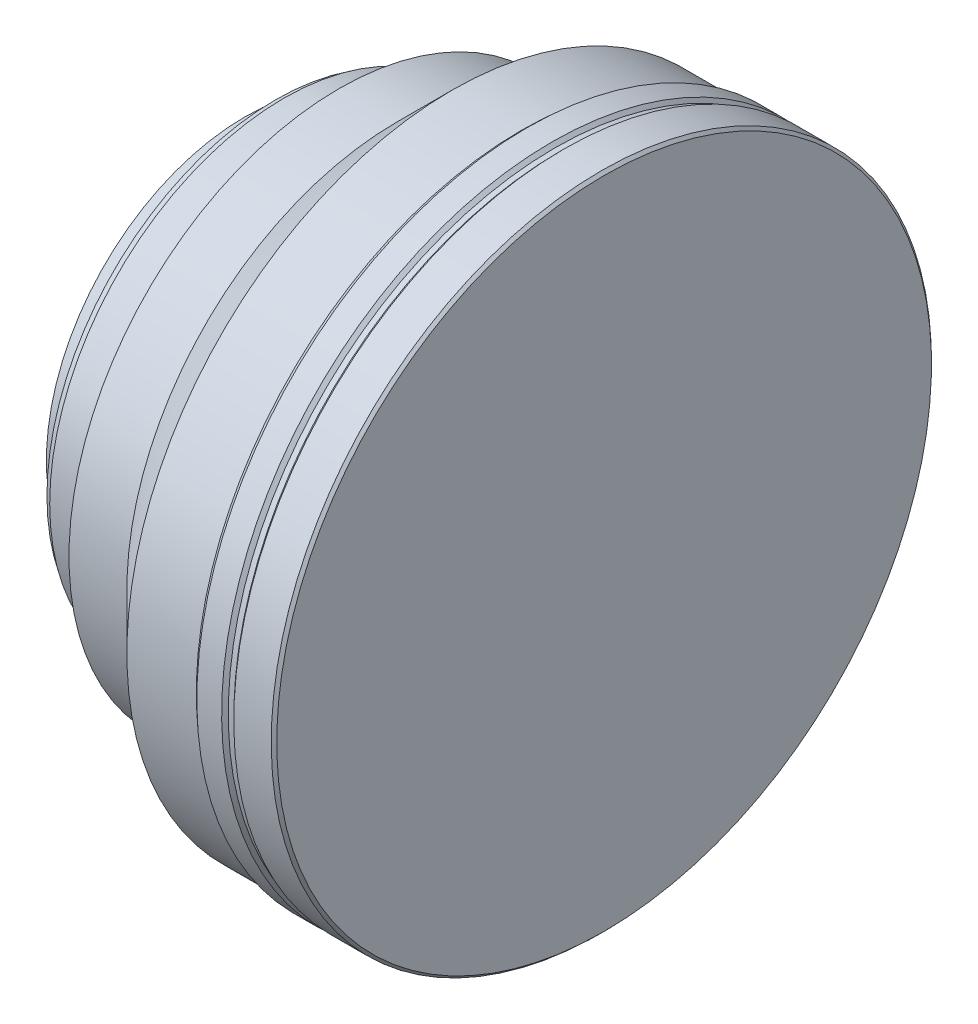
ISO-10303-21;
HEADER;
FILE_DESCRIPTION(('STEP AP214'),'2;1');
FILE_NAME('part.step','',(''),(''),'','','');
FILE_SCHEMA(('AUTOMOTIVE_DESIGN { 1 0 10303 214 1 1 1 1 }'));
ENDSEC;
DATA;
#1=APPLICATION_CONTEXT('core data for automotive mechanical design processes');
#2=APPLICATION_PROTOCOL_DEFINITION('international standard','automotive_design',2000,#1);
#3=PRODUCT_CONTEXT('',#1,'mechanical');
#4=PRODUCT('Part','Part','',(#3));
#5=PRODUCT_RELATED_PRODUCT_CATEGORY('part','',(#4));
#6=PRODUCT_DEFINITION_FORMATION('','',#4);
#7=PRODUCT_DEFINITION_CONTEXT('part definition',#1,'design');
#8=PRODUCT_DEFINITION('design','',#6,#7);
#9=PRODUCT_DEFINITION_SHAPE('','',#8);
#10=(LENGTH_UNIT() NAMED_UNIT(*) SI_UNIT(.MILLI.,.METRE.));
#11=(NAMED_UNIT(*) PLANE_ANGLE_UNIT() SI_UNIT($,.RADIAN.));
#12=(NAMED_UNIT(*) SI_UNIT($,.STERADIAN.) SOLID_ANGLE_UNIT());
#13=UNCERTAINTY_MEASURE_WITH_UNIT(LENGTH_MEASURE(1.E-05),#10,'distance_accuracy_value','');
#14=(GEOMETRIC_REPRESENTATION_CONTEXT(3) GLOBAL_UNCERTAINTY_ASSIGNED_CONTEXT((#13)) GLOBAL_UNIT_ASSIGNED_CONTEXT((#10,
#11,#12)) REPRESENTATION_CONTEXT('',''));
#15=CARTESIAN_POINT('',(0.,0.,0.));
#16=DIRECTION('',(0.,0.,1.));
#17=DIRECTION('',(1.,0.,0.));
#18=AXIS2_PLACEMENT_3D('',#15,#16,#17);
#19=CARTESIAN_POINT('',(0.,0.,0.));
#20=DIRECTION('',(1.,0.,0.));
#21=DIRECTION('',(0.,1.,0.));
#22=AXIS2_PLACEMENT_3D('',#19,#20,#21);
#23=PLANE('',#22);
#24=CARTESIAN_POINT('',(0.,0.,0.));
#25=DIRECTION('',(1.,0.,0.));
#26=DIRECTION('',(0.,1.,0.));
#27=AXIS2_PLACEMENT_3D('',#24,#25,#26);
#28=CIRCLE('',#27,59.4);
#29=CARTESIAN_POINT('',(0.,59.4,0.));
#30=VERTEX_POINT('',#29);
#31=EDGE_CURVE('E42',#30,#30,#28,.T.);
#32=ORIENTED_EDGE('',*,*,#31,.T.);
#33=EDGE_LOOP('',(#32));
#34=FACE_BOUND('',#33,.T.);
#35=ADVANCED_FACE('F34',(#34),#23,.T.);
#36=CARTESIAN_POINT('',(0.,0.,0.));
#37=DIRECTION('',(1.,0.,0.));
#38=DIRECTION('',(0.,1.,0.));
#39=AXIS2_PLACEMENT_3D('',#36,#37,#38);
#40=CYLINDRICAL_SURFACE('',#39,59.9);
#41=CARTESIAN_POINT('',(-0.49999999999999,0.,0.));
#42=DIRECTION('',(1.,0.,0.));
#43=DIRECTION('',(0.,1.,0.));
#44=AXIS2_PLACEMENT_3D('',#41,#42,#43);
#45=CIRCLE('',#44,59.9);
#46=CARTESIAN_POINT('',(-0.499999999999997,59.9,0.));
#47=VERTEX_POINT('',#46);
#48=EDGE_CURVE('E10',#47,#47,#45,.F.);
#49=ORIENTED_EDGE('',*,*,#48,.T.);
#50=EDGE_LOOP('',(#49));
#51=FACE_BOUND('',#50,.T.);
#52=CARTESIAN_POINT('',(-7.29999999999998,0.,0.));
#53=DIRECTION('',(1.,0.,0.));
#54=DIRECTION('',(0.,1.,0.));
#55=AXIS2_PLACEMENT_3D('',#52,#53,#54);
#56=CIRCLE('',#55,59.9);
#57=CARTESIAN_POINT('',(-7.29999999999998,59.9,0.));
#58=VERTEX_POINT('',#57);
#59=EDGE_CURVE('E46',#58,#58,#56,.T.);
#60=ORIENTED_EDGE('',*,*,#59,.T.);
#61=EDGE_LOOP('',(#60));
#62=FACE_BOUND('',#61,.T.);
#63=ADVANCED_FACE('F127',(#51,#62),#40,.T.);
#64=CARTESIAN_POINT('',(-7.29999999999998,0.,0.));
#65=DIRECTION('',(1.,0.,0.));
#66=DIRECTION('',(0.,1.,0.));
#67=AXIS2_PLACEMENT_3D('',#64,#65,#66);
#68=CONICAL_SURFACE('',#67,59.9,0.78539816339744);
#69=CARTESIAN_POINT('',(-7.89999999999999,0.,0.));
#70=DIRECTION('',(1.,0.,0.));
#71=DIRECTION('',(0.,1.,0.));
#72=AXIS2_PLACEMENT_3D('',#69,#70,#71);
#73=CIRCLE('',#72,59.3);
#74=CARTESIAN_POINT('',(-7.9,59.3,0.));
#75=VERTEX_POINT('',#74);
#76=EDGE_CURVE('E50',#75,#75,#73,.T.);
#77=ORIENTED_EDGE('',*,*,#76,.T.);
#78=EDGE_LOOP('',(#77));
#79=FACE_BOUND('',#78,.T.);
#80=ORIENTED_EDGE('',*,*,#59,.F.);
#81=EDGE_LOOP('',(#80));
#82=FACE_BOUND('',#81,.T.);
#83=ADVANCED_FACE('F131',(#79,#82),#68,.T.);
#84=CARTESIAN_POINT('',(0.,0.,0.));
#85=DIRECTION('',(1.,0.,0.));
#86=DIRECTION('',(0.,1.,0.));
#87=AXIS2_PLACEMENT_3D('',#84,#85,#86);
#88=CYLINDRICAL_SURFACE('',#87,59.3);
#89=CARTESIAN_POINT('',(-8.89999999999999,0.,0.));
#90=DIRECTION('',(1.,0.,0.));
#91=DIRECTION('',(0.,1.,0.));
#92=AXIS2_PLACEMENT_3D('',#89,#90,#91);
#93=CIRCLE('',#92,59.3);
#94=CARTESIAN_POINT('',(-8.9,59.3,0.));
#95=VERTEX_POINT('',#94);
#96=EDGE_CURVE('E55',#95,#95,#93,.T.);
#97=ORIENTED_EDGE('',*,*,#96,.T.);
#98=EDGE_LOOP('',(#97));
#99=FACE_BOUND('',#98,.T.);
#100=ORIENTED_EDGE('',*,*,#76,.F.);
#101=EDGE_LOOP('',(#100));
#102=FACE_BOUND('',#101,.T.);
#103=ADVANCED_FACE('F136',(#99,#102),#88,.T.);
#104=CARTESIAN_POINT('',(-8.89999999999999,0.,0.));
#105=DIRECTION('',(-1.,0.,0.));
#106=DIRECTION('',(0.,-1.,0.));
#107=AXIS2_PLACEMENT_3D('',#104,#105,#106);
#108=CONICAL_SURFACE('',#107,59.3,0.785398163397443);
#109=CARTESIAN_POINT('',(-9.5,0.,0.));
#110=DIRECTION('',(1.,0.,0.));
#111=DIRECTION('',(0.,1.,0.));
#112=AXIS2_PLACEMENT_3D('',#109,#110,#111);
#113=CIRCLE('',#112,59.9);
#114=CARTESIAN_POINT('',(-9.50000000000001,59.9,0.));
#115=VERTEX_POINT('',#114);
#116=EDGE_CURVE('E58',#115,#115,#113,.T.);
#117=ORIENTED_EDGE('',*,*,#116,.T.);
#118=EDGE_LOOP('',(#117));
#119=FACE_BOUND('',#118,.T.);
#120=ORIENTED_EDGE('',*,*,#96,.F.);
#121=EDGE_LOOP('',(#120));
#122=FACE_BOUND('',#121,.T.);
#123=ADVANCED_FACE('F140',(#119,#122),#108,.T.);
#124=CARTESIAN_POINT('',(0.,0.,0.));
#125=DIRECTION('',(1.,0.,0.));
#126=DIRECTION('',(0.,1.,0.));
#127=AXIS2_PLACEMENT_3D('',#124,#125,#126);
#128=CYLINDRICAL_SURFACE('',#127,59.9);
#129=CARTESIAN_POINT('',(-14.,0.,0.));
#130=DIRECTION('',(1.,0.,0.));
#131=DIRECTION('',(0.,1.,0.));
#132=AXIS2_PLACEMENT_3D('',#129,#130,#131);
#133=CIRCLE('',#132,59.9);
#134=CARTESIAN_POINT('',(-14.,59.9,0.));
#135=VERTEX_POINT('',#134);
#136=EDGE_CURVE('E61',#135,#135,#133,.T.);
#137=ORIENTED_EDGE('',*,*,#136,.T.);
#138=EDGE_LOOP('',(#137));
#139=FACE_BOUND('',#138,.T.);
#140=ORIENTED_EDGE('',*,*,#116,.F.);
#141=EDGE_LOOP('',(#140));
#142=FACE_BOUND('',#141,.T.);
#143=ADVANCED_FACE('F144',(#139,#142),#128,.T.);
#144=CARTESIAN_POINT('',(-14.,0.,0.));
#145=DIRECTION('',(1.,0.,0.));
#146=DIRECTION('',(0.,1.,0.));
#147=AXIS2_PLACEMENT_3D('',#144,#145,#146);
#148=CONICAL_SURFACE('',#147,59.9,0.73281510178651);
#149=CARTESIAN_POINT('',(-15.,0.,0.));
#150=DIRECTION('',(1.,0.,0.));
#151=DIRECTION('',(0.,1.,0.));
#152=AXIS2_PLACEMENT_3D('',#149,#150,#151);
#153=CIRCLE('',#152,59.);
#154=CARTESIAN_POINT('',(-15.,59.,0.));
#155=VERTEX_POINT('',#154);
#156=EDGE_CURVE('E64',#155,#155,#153,.T.);
#157=ORIENTED_EDGE('',*,*,#156,.T.);
#158=EDGE_LOOP('',(#157));
#159=FACE_BOUND('',#158,.T.);
#160=ORIENTED_EDGE('',*,*,#136,.F.);
#161=EDGE_LOOP('',(#160));
#162=FACE_BOUND('',#161,.T.);
#163=ADVANCED_FACE('F148',(#159,#162),#148,.T.);
#164=CARTESIAN_POINT('',(0.,0.,0.));
#165=DIRECTION('',(1.,0.,0.));
#166=DIRECTION('',(0.,1.,0.));
#167=AXIS2_PLACEMENT_3D('',#164,#165,#166);
#168=CYLINDRICAL_SURFACE('',#167,59.);
#169=CARTESIAN_POINT('',(-27.6,0.,0.));
#170=DIRECTION('',(1.,0.,0.));
#171=DIRECTION('',(0.,1.,0.));
#172=AXIS2_PLACEMENT_3D('',#169,#170,#171);
#173=CIRCLE('',#172,59.);
#174=CARTESIAN_POINT('',(-27.6,59.,0.));
#175=VERTEX_POINT('',#174);
#176=EDGE_CURVE('E67',#175,#175,#173,.T.);
#177=ORIENTED_EDGE('',*,*,#176,.T.);
#178=EDGE_LOOP('',(#177));
#179=FACE_BOUND('',#178,.T.);
#180=ORIENTED_EDGE('',*,*,#156,.F.);
#181=EDGE_LOOP('',(#180));
#182=FACE_BOUND('',#181,.T.);
#183=ADVANCED_FACE('F152',(#179,#182),#168,.T.);
#184=CARTESIAN_POINT('',(-27.6,0.,0.));
#185=DIRECTION('',(1.,0.,0.));
#186=DIRECTION('',(0.,1.,0.));
#187=AXIS2_PLACEMENT_3D('',#184,#185,#186);
#188=CONICAL_SURFACE('',#187,59.,0.78539816339745);
#189=CARTESIAN_POINT('',(-37.6,0.,0.));
#190=DIRECTION('',(1.,0.,0.));
#191=DIRECTION('',(0.,1.,0.));
#192=AXIS2_PLACEMENT_3D('',#189,#190,#191);
#193=CIRCLE('',#192,49.);
#194=CARTESIAN_POINT('',(-37.6,49.,0.));
#195=VERTEX_POINT('',#194);
#196=EDGE_CURVE('E70',#195,#195,#193,.T.);
#197=ORIENTED_EDGE('',*,*,#196,.T.);
#198=EDGE_LOOP('',(#197));
#199=FACE_BOUND('',#198,.T.);
#200=ORIENTED_EDGE('',*,*,#176,.F.);
#201=EDGE_LOOP('',(#200));
#202=FACE_BOUND('',#201,.T.);
#203=ADVANCED_FACE('F156',(#199,#202),#188,.T.);
#204=CARTESIAN_POINT('',(0.,0.,0.));
#205=DIRECTION('',(1.,0.,0.));
#206=DIRECTION('',(0.,1.,0.));
#207=AXIS2_PLACEMENT_3D('',#204,#205,#206);
#208=CYLINDRICAL_SURFACE('',#207,49.);
#209=CARTESIAN_POINT('',(-48.1,0.,0.));
#210=DIRECTION('',(1.,0.,0.));
#211=DIRECTION('',(0.,1.,0.));
#212=AXIS2_PLACEMENT_3D('',#209,#210,#211);
#213=CIRCLE('',#212,49.);
#214=CARTESIAN_POINT('',(-48.1,49.,0.));
#215=VERTEX_POINT('',#214);
#216=EDGE_CURVE('E73',#215,#215,#213,.T.);
#217=ORIENTED_EDGE('',*,*,#216,.T.);
#218=EDGE_LOOP('',(#217));
#219=FACE_BOUND('',#218,.T.);
#220=ORIENTED_EDGE('',*,*,#196,.F.);
#221=EDGE_LOOP('',(#220));
#222=FACE_BOUND('',#221,.T.);
#223=ADVANCED_FACE('F160',(#219,#222),#208,.T.);
#224=CARTESIAN_POINT('',(-48.1,49.,0.));
#225=DIRECTION('',(-1.,0.,0.));
#226=DIRECTION('',(0.,-1.,0.));
#227=AXIS2_PLACEMENT_3D('',#224,#225,#226);
#228=PLANE('',#227);
#229=CARTESIAN_POINT('',(-48.1,0.,0.));
#230=DIRECTION('',(1.,0.,0.));
#231=DIRECTION('',(0.,1.,0.));
#232=AXIS2_PLACEMENT_3D('',#229,#230,#231);
#233=CIRCLE('',#232,45.25);
#234=CARTESIAN_POINT('',(-48.1,45.25,0.));
#235=VERTEX_POINT('',#234);
#236=EDGE_CURVE('E76',#235,#235,#233,.T.);
#237=ORIENTED_EDGE('',*,*,#236,.T.);
#238=EDGE_LOOP('',(#237));
#239=FACE_BOUND('',#238,.T.);
#240=ORIENTED_EDGE('',*,*,#216,.F.);
#241=EDGE_LOOP('',(#240));
#242=FACE_BOUND('',#241,.T.);
#243=ADVANCED_FACE('F164',(#239,#242),#228,.T.);
#244=CARTESIAN_POINT('',(0.,0.,0.));
#245=DIRECTION('',(1.,0.,0.));
#246=DIRECTION('',(0.,1.,0.));
#247=AXIS2_PLACEMENT_3D('',#244,#245,#246);
#248=CYLINDRICAL_SURFACE('',#247,45.25);
#249=CARTESIAN_POINT('',(-48.8,0.,0.));
#250=DIRECTION('',(1.,0.,0.));
#251=DIRECTION('',(0.,1.,0.));
#252=AXIS2_PLACEMENT_3D('',#249,#250,#251);
#253=CIRCLE('',#252,45.25);
#254=CARTESIAN_POINT('',(-48.8,45.25,0.));
#255=VERTEX_POINT('',#254);
#256=EDGE_CURVE('E79',#255,#255,#253,.T.);
#257=ORIENTED_EDGE('',*,*,#256,.T.);
#258=EDGE_LOOP('',(#257));
#259=FACE_BOUND('',#258,.T.);
#260=ORIENTED_EDGE('',*,*,#236,.F.);
#261=EDGE_LOOP('',(#260));
#262=FACE_BOUND('',#261,.T.);
#263=ADVANCED_FACE('F168',(#259,#262),#248,.T.);
#264=CARTESIAN_POINT('',(-48.8,45.25,0.));
#265=DIRECTION('',(-1.,0.,0.));
#266=DIRECTION('',(0.,-1.,0.));
#267=AXIS2_PLACEMENT_3D('',#264,#265,#266);
#268=PLANE('',#267);
#269=CARTESIAN_POINT('',(-48.8,0.,0.));
#270=DIRECTION('',(1.,0.,0.));
#271=DIRECTION('',(0.,1.,0.));
#272=AXIS2_PLACEMENT_3D('',#269,#270,#271);
#273=CIRCLE('',#272,41.5);
#274=CARTESIAN_POINT('',(-48.8,41.5,0.));
#275=VERTEX_POINT('',#274);
#276=EDGE_CURVE('E82',#275,#275,#273,.T.);
#277=ORIENTED_EDGE('',*,*,#276,.T.);
#278=EDGE_LOOP('',(#277));
#279=FACE_BOUND('',#278,.T.);
#280=ORIENTED_EDGE('',*,*,#256,.F.);
#281=EDGE_LOOP('',(#280));
#282=FACE_BOUND('',#281,.T.);
#283=ADVANCED_FACE('F172',(#279,#282),#268,.T.);
#284=CARTESIAN_POINT('',(0.,0.,0.));
#285=DIRECTION('',(1.,0.,0.));
#286=DIRECTION('',(0.,1.,0.));
#287=AXIS2_PLACEMENT_3D('',#284,#285,#286);
#288=CYLINDRICAL_SURFACE('',#287,41.5);
#289=CARTESIAN_POINT('',(-50.8,0.,0.));
#290=DIRECTION('',(1.,0.,0.));
#291=DIRECTION('',(0.,1.,0.));
#292=AXIS2_PLACEMENT_3D('',#289,#290,#291);
#293=CIRCLE('',#292,41.5);
#294=CARTESIAN_POINT('',(-50.8,41.5,0.));
#295=VERTEX_POINT('',#294);
#296=EDGE_CURVE('E85',#295,#295,#293,.T.);
#297=ORIENTED_EDGE('',*,*,#296,.T.);
#298=EDGE_LOOP('',(#297));
#299=FACE_BOUND('',#298,.T.);
#300=ORIENTED_EDGE('',*,*,#276,.F.);
#301=EDGE_LOOP('',(#300));
#302=FACE_BOUND('',#301,.T.);
#303=ADVANCED_FACE('F176',(#299,#302),#288,.T.);
#304=CARTESIAN_POINT('',(-50.8,41.5,0.));
#305=DIRECTION('',(1.,0.,0.));
#306=DIRECTION('',(0.,1.,0.));
#307=AXIS2_PLACEMENT_3D('',#304,#305,#306);
#308=PLANE('',#307);
#309=CARTESIAN_POINT('',(-50.8,0.,0.));
#310=DIRECTION('',(1.,0.,0.));
#311=DIRECTION('',(0.,1.,0.));
#312=AXIS2_PLACEMENT_3D('',#309,#310,#311);
#313=CIRCLE('',#312,42.5);
#314=CARTESIAN_POINT('',(-50.8,42.5,0.));
#315=VERTEX_POINT('',#314);
#316=EDGE_CURVE('E88',#315,#315,#313,.T.);
#317=ORIENTED_EDGE('',*,*,#316,.T.);
#318=EDGE_LOOP('',(#317));
#319=FACE_BOUND('',#318,.T.);
#320=ORIENTED_EDGE('',*,*,#296,.F.);
#321=EDGE_LOOP('',(#320));
#322=FACE_BOUND('',#321,.T.);
#323=ADVANCED_FACE('F180',(#319,#322),#308,.T.);
#324=CARTESIAN_POINT('',(0.,0.,0.));
#325=DIRECTION('',(1.,0.,0.));
#326=DIRECTION('',(0.,1.,0.));
#327=AXIS2_PLACEMENT_3D('',#324,#325,#326);
#328=CYLINDRICAL_SURFACE('',#327,42.5);
#329=CARTESIAN_POINT('',(-58.1,0.,0.));
#330=DIRECTION('',(1.,0.,0.));
#331=DIRECTION('',(0.,1.,0.));
#332=AXIS2_PLACEMENT_3D('',#329,#330,#331);
#333=CIRCLE('',#332,42.5);
#334=CARTESIAN_POINT('',(-58.1,42.5,0.));
#335=VERTEX_POINT('',#334);
#336=EDGE_CURVE('E91',#335,#335,#333,.T.);
#337=ORIENTED_EDGE('',*,*,#336,.T.);
#338=EDGE_LOOP('',(#337));
#339=FACE_BOUND('',#338,.T.);
#340=ORIENTED_EDGE('',*,*,#316,.F.);
#341=EDGE_LOOP('',(#340));
#342=FACE_BOUND('',#341,.T.);
#343=ADVANCED_FACE('F184',(#339,#342),#328,.T.);
#344=CARTESIAN_POINT('',(-58.1,42.5,0.));
#345=DIRECTION('',(-1.,0.,0.));
#346=DIRECTION('',(0.,-1.,0.));
#347=AXIS2_PLACEMENT_3D('',#344,#345,#346);
#348=PLANE('',#347);
#349=CARTESIAN_POINT('',(-58.1,0.,0.));
#350=DIRECTION('',(1.,0.,0.));
#351=DIRECTION('',(0.,1.,0.));
#352=AXIS2_PLACEMENT_3D('',#349,#350,#351);
#353=CIRCLE('',#352,41.5);
#354=CARTESIAN_POINT('',(-58.1,41.5,0.));
#355=VERTEX_POINT('',#354);
#356=EDGE_CURVE('E94',#355,#355,#353,.T.);
#357=ORIENTED_EDGE('',*,*,#356,.T.);
#358=EDGE_LOOP('',(#357));
#359=FACE_BOUND('',#358,.T.);
#360=ORIENTED_EDGE('',*,*,#336,.F.);
#361=EDGE_LOOP('',(#360));
#362=FACE_BOUND('',#361,.T.);
#363=ADVANCED_FACE('F188',(#359,#362),#348,.T.);
#364=CARTESIAN_POINT('',(0.,0.,0.));
#365=DIRECTION('',(1.,0.,0.));
#366=DIRECTION('',(0.,1.,0.));
#367=AXIS2_PLACEMENT_3D('',#364,#365,#366);
#368=CYLINDRICAL_SURFACE('',#367,41.5);
#369=CARTESIAN_POINT('',(-59.6,0.,0.));
#370=DIRECTION('',(1.,0.,0.));
#371=DIRECTION('',(0.,1.,0.));
#372=AXIS2_PLACEMENT_3D('',#369,#370,#371);
#373=CIRCLE('',#372,41.5);
#374=CARTESIAN_POINT('',(-59.6,41.5,0.));
#375=VERTEX_POINT('',#374);
#376=EDGE_CURVE('E97',#375,#375,#373,.T.);
#377=ORIENTED_EDGE('',*,*,#376,.T.);
#378=EDGE_LOOP('',(#377));
#379=FACE_BOUND('',#378,.T.);
#380=ORIENTED_EDGE('',*,*,#356,.F.);
#381=EDGE_LOOP('',(#380));
#382=FACE_BOUND('',#381,.T.);
#383=ADVANCED_FACE('F192',(#379,#382),#368,.T.);
#384=CARTESIAN_POINT('',(-59.6,41.5,0.));
#385=DIRECTION('',(-1.,0.,0.));
#386=DIRECTION('',(0.,-1.,0.));
#387=AXIS2_PLACEMENT_3D('',#384,#385,#386);
#388=PLANE('',#387);
#389=CARTESIAN_POINT('',(-59.6,0.,0.));
#390=DIRECTION('',(1.,0.,0.));
#391=DIRECTION('',(0.,1.,0.));
#392=AXIS2_PLACEMENT_3D('',#389,#390,#391);
#393=CIRCLE('',#392,36.);
#394=CARTESIAN_POINT('',(-59.6,36.,0.));
#395=VERTEX_POINT('',#394);
#396=EDGE_CURVE('E100',#395,#395,#393,.T.);
#397=ORIENTED_EDGE('',*,*,#396,.T.);
#398=EDGE_LOOP('',(#397));
#399=FACE_BOUND('',#398,.T.);
#400=ORIENTED_EDGE('',*,*,#376,.F.);
#401=EDGE_LOOP('',(#400));
#402=FACE_BOUND('',#401,.T.);
#403=ADVANCED_FACE('F196',(#399,#402),#388,.T.);
#404=CARTESIAN_POINT('',(0.,0.,0.));
#405=DIRECTION('',(1.,0.,0.));
#406=DIRECTION('',(0.,1.,0.));
#407=AXIS2_PLACEMENT_3D('',#404,#405,#406);
#408=CYLINDRICAL_SURFACE('',#407,36.);
#409=CARTESIAN_POINT('',(-65.2,0.,0.));
#410=DIRECTION('',(1.,0.,0.));
#411=DIRECTION('',(0.,1.,0.));
#412=AXIS2_PLACEMENT_3D('',#409,#410,#411);
#413=CIRCLE('',#412,36.);
#414=CARTESIAN_POINT('',(-65.2,36.,0.));
#415=VERTEX_POINT('',#414);
#416=EDGE_CURVE('E103',#415,#415,#413,.T.);
#417=ORIENTED_EDGE('',*,*,#416,.T.);
#418=EDGE_LOOP('',(#417));
#419=FACE_BOUND('',#418,.T.);
#420=ORIENTED_EDGE('',*,*,#396,.F.);
#421=EDGE_LOOP('',(#420));
#422=FACE_BOUND('',#421,.T.);
#423=ADVANCED_FACE('F200',(#419,#422),#408,.T.);
#424=CARTESIAN_POINT('',(-65.2,36.,0.));
#425=DIRECTION('',(-1.,0.,0.));
#426=DIRECTION('',(0.,-1.,0.));
#427=AXIS2_PLACEMENT_3D('',#424,#425,#426);
#428=PLANE('',#427);
#429=CARTESIAN_POINT('',(-65.2,0.,0.));
#430=DIRECTION('',(1.,0.,0.));
#431=DIRECTION('',(0.,1.,0.));
#432=AXIS2_PLACEMENT_3D('',#429,#430,#431);
#433=CIRCLE('',#432,32.);
#434=CARTESIAN_POINT('',(-65.2,32.,0.));
#435=VERTEX_POINT('',#434);
#436=EDGE_CURVE('E106',#435,#435,#433,.T.);
#437=ORIENTED_EDGE('',*,*,#436,.T.);
#438=EDGE_LOOP('',(#437));
#439=FACE_BOUND('',#438,.T.);
#440=ORIENTED_EDGE('',*,*,#416,.F.);
#441=EDGE_LOOP('',(#440));
#442=FACE_BOUND('',#441,.T.);
#443=ADVANCED_FACE('F124',(#439,#442),#428,.T.);
#444=CARTESIAN_POINT('',(0.,0.,0.));
#445=DIRECTION('',(1.,0.,0.));
#446=DIRECTION('',(0.,1.,0.));
#447=AXIS2_PLACEMENT_3D('',#444,#445,#446);
#448=CYLINDRICAL_SURFACE('',#447,32.);
#449=CARTESIAN_POINT('',(-66.2,0.,0.));
#450=DIRECTION('',(1.,0.,0.));
#451=DIRECTION('',(0.,1.,0.));
#452=AXIS2_PLACEMENT_3D('',#449,#450,#451);
#453=CIRCLE('',#452,32.);
#454=CARTESIAN_POINT('',(-66.2,32.,0.));
#455=VERTEX_POINT('',#454);
#456=EDGE_CURVE('E109',#455,#455,#453,.T.);
#457=ORIENTED_EDGE('',*,*,#456,.T.);
#458=EDGE_LOOP('',(#457));
#459=FACE_BOUND('',#458,.T.);
#460=ORIENTED_EDGE('',*,*,#436,.F.);
#461=EDGE_LOOP('',(#460));
#462=FACE_BOUND('',#461,.T.);
#463=ADVANCED_FACE('F113',(#459,#462),#448,.T.);
#464=CARTESIAN_POINT('',(-66.2,32.,0.));
#465=DIRECTION('',(-1.,0.,0.));
#466=DIRECTION('',(0.,-1.,0.));
#467=AXIS2_PLACEMENT_3D('',#464,#465,#466);
#468=PLANE('',#467);
#469=ORIENTED_EDGE('',*,*,#456,.F.);
#470=EDGE_LOOP('',(#469));
#471=FACE_BOUND('',#470,.T.);
#472=ADVANCED_FACE('F116',(#471),#468,.T.);
#473=CARTESIAN_POINT('',(0.,0.,0.));
#474=DIRECTION('',(-1.,0.,0.));
#475=DIRECTION('',(0.,-1.,0.));
#476=AXIS2_PLACEMENT_3D('',#473,#474,#475);
#477=CONICAL_SURFACE('',#476,59.4,0.785398163397434);
#478=ORIENTED_EDGE('',*,*,#48,.F.);
#479=EDGE_LOOP('',(#478));
#480=FACE_BOUND('',#479,.T.);
#481=ORIENTED_EDGE('',*,*,#31,.F.);
#482=EDGE_LOOP('',(#481));
#483=FACE_BOUND('',#482,.T.);
#484=ADVANCED_FACE('F37',(#480,#483),#477,.T.);
#485=CLOSED_SHELL('',(#35,#63,#83,#103,#123,#143,#163,#183,#203,#223,#243,#263,#283,#303,#323,
#343,#363,#383,#403,#423,#443,#463,#472,#484));
#486=MANIFOLD_SOLID_BREP('B2',#485);
#487=ADVANCED_BREP_SHAPE_REPRESENTATION('',(#18,#486),#14);
#488=SHAPE_DEFINITION_REPRESENTATION(#9,#487);
ENDSEC;
END-ISO-10303-21;
